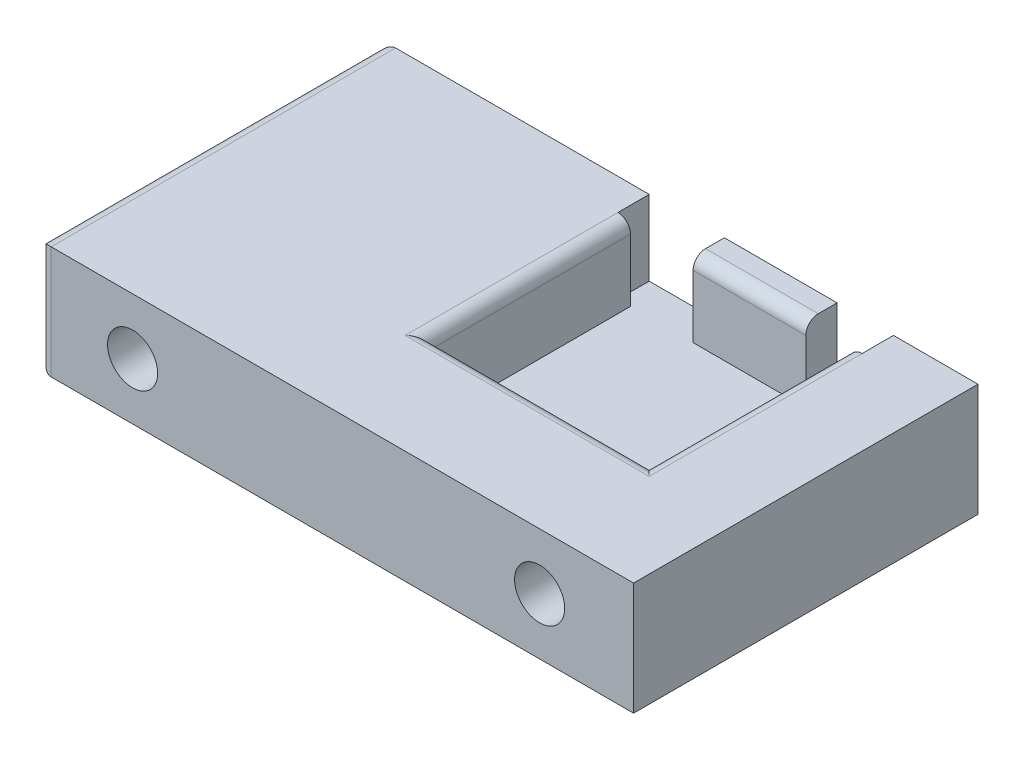
ISO-10303-21;
HEADER;
FILE_DESCRIPTION(('STEP AP214'),'2;1');
FILE_NAME('part.step','',(''),(''),'','','');
FILE_SCHEMA(('AUTOMOTIVE_DESIGN { 1 0 10303 214 1 1 1 1 }'));
ENDSEC;
DATA;
#1=APPLICATION_CONTEXT('core data for automotive mechanical design processes');
#2=APPLICATION_PROTOCOL_DEFINITION('international standard','automotive_design',2000,#1);
#3=PRODUCT_CONTEXT('',#1,'mechanical');
#4=PRODUCT('Part','Part','',(#3));
#5=PRODUCT_RELATED_PRODUCT_CATEGORY('part','',(#4));
#6=PRODUCT_DEFINITION_FORMATION('','',#4);
#7=PRODUCT_DEFINITION_CONTEXT('part definition',#1,'design');
#8=PRODUCT_DEFINITION('design','',#6,#7);
#9=PRODUCT_DEFINITION_SHAPE('','',#8);
#10=(LENGTH_UNIT() NAMED_UNIT(*) SI_UNIT(.MILLI.,.METRE.));
#11=(NAMED_UNIT(*) PLANE_ANGLE_UNIT() SI_UNIT($,.RADIAN.));
#12=(NAMED_UNIT(*) SI_UNIT($,.STERADIAN.) SOLID_ANGLE_UNIT());
#13=UNCERTAINTY_MEASURE_WITH_UNIT(LENGTH_MEASURE(1.E-05),#10,'distance_accuracy_value','');
#14=(GEOMETRIC_REPRESENTATION_CONTEXT(3) GLOBAL_UNCERTAINTY_ASSIGNED_CONTEXT((#13)) GLOBAL_UNIT_ASSIGNED_CONTEXT((#10,
#11,#12)) REPRESENTATION_CONTEXT('',''));
#15=CARTESIAN_POINT('',(0.,0.,0.));
#16=DIRECTION('',(0.,0.,1.));
#17=DIRECTION('',(1.,0.,0.));
#18=AXIS2_PLACEMENT_3D('',#15,#16,#17);
#19=CARTESIAN_POINT('',(0.,18.,0.));
#20=DIRECTION('',(0.,1.,0.));
#21=DIRECTION('',(0.,0.,1.));
#22=AXIS2_PLACEMENT_3D('',#19,#20,#21);
#23=PLANE('',#22);
#24=DIRECTION('',(0.,0.,1.));
#25=VECTOR('',#24,1.);
#26=CARTESIAN_POINT('',(72.5,18.,0.));
#27=LINE('',#26,#25);
#28=CARTESIAN_POINT('',(72.5,18.,0.));
#29=VERTEX_POINT('',#28);
#30=CARTESIAN_POINT('',(72.5,18.,3.));
#31=VERTEX_POINT('',#30);
#32=EDGE_CURVE('E193',#29,#31,#27,.T.);
#33=ORIENTED_EDGE('',*,*,#32,.F.);
#34=DIRECTION('',(-1.,0.,0.));
#35=VECTOR('',#34,1.);
#36=CARTESIAN_POINT('',(0.,18.,0.));
#37=LINE('',#36,#35);
#38=CARTESIAN_POINT('',(54.5,18.,0.));
#39=VERTEX_POINT('',#38);
#40=EDGE_CURVE('E238',#29,#39,#37,.T.);
#41=ORIENTED_EDGE('',*,*,#40,.T.);
#42=DIRECTION('',(0.,0.,-1.));
#43=VECTOR('',#42,1.);
#44=CARTESIAN_POINT('',(54.5,18.,0.));
#45=LINE('',#44,#43);
#46=CARTESIAN_POINT('',(54.5,18.,3.));
#47=VERTEX_POINT('',#46);
#48=EDGE_CURVE('E337',#47,#39,#45,.T.);
#49=ORIENTED_EDGE('',*,*,#48,.F.);
#50=DIRECTION('',(-1.,0.,0.));
#51=VECTOR('',#50,1.);
#52=CARTESIAN_POINT('',(79.5,18.,3.));
#53=LINE('',#52,#51);
#54=EDGE_CURVE('E266',#47,#31,#53,.F.);
#55=ORIENTED_EDGE('',*,*,#54,.T.);
#56=EDGE_LOOP('',(#33,#41,#49,#55));
#57=FACE_BOUND('',#56,.T.);
#58=ADVANCED_FACE('F37',(#57),#23,.T.);
#59=CARTESIAN_POINT('',(0.,18.,0.));
#60=DIRECTION('',(1.,0.,0.));
#61=DIRECTION('',(0.,0.,-1.));
#62=AXIS2_PLACEMENT_3D('',#59,#60,#61);
#63=PLANE('',#62);
#64=DIRECTION('',(0.,0.,1.));
#65=VECTOR('',#64,1.);
#66=CARTESIAN_POINT('',(0.,16.,0.));
#67=LINE('',#66,#65);
#68=CARTESIAN_POINT('',(0.,16.,53.));
#69=VERTEX_POINT('',#68);
#70=CARTESIAN_POINT('',(0.,16.,2.));
#71=VERTEX_POINT('',#70);
#72=EDGE_CURVE('E253',#69,#71,#67,.F.);
#73=ORIENTED_EDGE('',*,*,#72,.T.);
#74=DIRECTION('',(0.,-1.,0.));
#75=VECTOR('',#74,1.);
#76=CARTESIAN_POINT('',(0.,18.,2.));
#77=LINE('',#76,#75);
#78=CARTESIAN_POINT('',(0.,2.,2.));
#79=VERTEX_POINT('',#78);
#80=EDGE_CURVE('E255',#71,#79,#77,.T.);
#81=ORIENTED_EDGE('',*,*,#80,.T.);
#82=DIRECTION('',(0.,0.,1.));
#83=VECTOR('',#82,1.);
#84=CARTESIAN_POINT('',(0.,2.,0.));
#85=LINE('',#84,#83);
#86=CARTESIAN_POINT('',(0.,2.,53.));
#87=VERTEX_POINT('',#86);
#88=EDGE_CURVE('E251',#79,#87,#85,.T.);
#89=ORIENTED_EDGE('',*,*,#88,.T.);
#90=DIRECTION('',(0.,-1.,0.));
#91=VECTOR('',#90,1.);
#92=CARTESIAN_POINT('',(0.,18.,53.));
#93=LINE('',#92,#91);
#94=EDGE_CURVE('E249',#87,#69,#93,.F.);
#95=ORIENTED_EDGE('',*,*,#94,.T.);
#96=EDGE_LOOP('',(#73,#81,#89,#95));
#97=FACE_BOUND('',#96,.T.);
#98=ADVANCED_FACE('F379',(#97),#63,.F.);
#99=CARTESIAN_POINT('',(0.,18.,55.));
#100=DIRECTION('',(0.,0.,-1.));
#101=DIRECTION('',(-1.,0.,0.));
#102=AXIS2_PLACEMENT_3D('',#99,#100,#101);
#103=PLANE('',#102);
#104=CARTESIAN_POINT('',(80.,9.,55.));
#105=DIRECTION('',(0.,0.,1.));
#106=DIRECTION('',(1.,0.,0.));
#107=AXIS2_PLACEMENT_3D('',#104,#105,#106);
#108=CIRCLE('',#107,4.00000000000001);
#109=CARTESIAN_POINT('',(84.,9.,55.));
#110=VERTEX_POINT('',#109);
#111=EDGE_CURVE('E220',#110,#110,#108,.T.);
#112=ORIENTED_EDGE('',*,*,#111,.F.);
#113=EDGE_LOOP('',(#112));
#114=FACE_BOUND('',#113,.T.);
#115=CARTESIAN_POINT('',(15.,9.,55.));
#116=DIRECTION('',(0.,0.,1.));
#117=DIRECTION('',(1.,0.,0.));
#118=AXIS2_PLACEMENT_3D('',#115,#116,#117);
#119=CIRCLE('',#118,4.);
#120=CARTESIAN_POINT('',(19.,9.,55.));
#121=VERTEX_POINT('',#120);
#122=EDGE_CURVE('E211',#121,#121,#119,.T.);
#123=ORIENTED_EDGE('',*,*,#122,.F.);
#124=EDGE_LOOP('',(#123));
#125=FACE_BOUND('',#124,.T.);
#126=DIRECTION('',(1.,0.,0.));
#127=VECTOR('',#126,1.);
#128=CARTESIAN_POINT('',(0.,18.,55.));
#129=LINE('',#128,#127);
#130=CARTESIAN_POINT('',(2.00000000000001,18.,55.));
#131=VERTEX_POINT('',#130);
#132=CARTESIAN_POINT('',(95.,18.,55.));
#133=VERTEX_POINT('',#132);
#134=EDGE_CURVE('E228',#131,#133,#129,.T.);
#135=ORIENTED_EDGE('',*,*,#134,.F.);
#136=DIRECTION('',(0.,-1.,0.));
#137=VECTOR('',#136,1.);
#138=CARTESIAN_POINT('',(2.00000000000001,18.,55.));
#139=LINE('',#138,#137);
#140=CARTESIAN_POINT('',(2.00000000000001,0.,55.));
#141=VERTEX_POINT('',#140);
#142=EDGE_CURVE('E277',#131,#141,#139,.T.);
#143=ORIENTED_EDGE('',*,*,#142,.T.);
#144=DIRECTION('',(1.,0.,0.));
#145=VECTOR('',#144,1.);
#146=CARTESIAN_POINT('',(0.,0.,55.));
#147=LINE('',#146,#145);
#148=CARTESIAN_POINT('',(95.,0.,55.));
#149=VERTEX_POINT('',#148);
#150=EDGE_CURVE('E219',#141,#149,#147,.T.);
#151=ORIENTED_EDGE('',*,*,#150,.T.);
#152=DIRECTION('',(0.,-1.,0.));
#153=VECTOR('',#152,1.);
#154=CARTESIAN_POINT('',(95.,18.,55.));
#155=LINE('',#154,#153);
#156=EDGE_CURVE('E246',#133,#149,#155,.T.);
#157=ORIENTED_EDGE('',*,*,#156,.F.);
#158=EDGE_LOOP('',(#135,#143,#151,#157));
#159=FACE_BOUND('',#158,.T.);
#160=ADVANCED_FACE('F385',(#114,#125,#159),#103,.F.);
#161=CARTESIAN_POINT('',(95.,18.,0.));
#162=DIRECTION('',(-1.,0.,0.));
#163=DIRECTION('',(0.,0.,1.));
#164=AXIS2_PLACEMENT_3D('',#161,#162,#163);
#165=PLANE('',#164);
#166=DIRECTION('',(0.,0.,-1.));
#167=VECTOR('',#166,1.);
#168=CARTESIAN_POINT('',(95.,0.,0.));
#169=LINE('',#168,#167);
#170=CARTESIAN_POINT('',(95.,0.,0.));
#171=VERTEX_POINT('',#170);
#172=EDGE_CURVE('E240',#149,#171,#169,.T.);
#173=ORIENTED_EDGE('',*,*,#172,.T.);
#174=DIRECTION('',(0.,-1.,0.));
#175=VECTOR('',#174,1.);
#176=CARTESIAN_POINT('',(95.,18.,0.));
#177=LINE('',#176,#175);
#178=CARTESIAN_POINT('',(95.,18.,0.));
#179=VERTEX_POINT('',#178);
#180=EDGE_CURVE('E237',#179,#171,#177,.T.);
#181=ORIENTED_EDGE('',*,*,#180,.F.);
#182=DIRECTION('',(0.,0.,-1.));
#183=VECTOR('',#182,1.);
#184=CARTESIAN_POINT('',(95.,18.,0.));
#185=LINE('',#184,#183);
#186=EDGE_CURVE('E230',#133,#179,#185,.T.);
#187=ORIENTED_EDGE('',*,*,#186,.F.);
#188=ORIENTED_EDGE('',*,*,#156,.T.);
#189=EDGE_LOOP('',(#173,#181,#187,#188));
#190=FACE_BOUND('',#189,.T.);
#191=ADVANCED_FACE('F399',(#190),#165,.F.);
#192=CARTESIAN_POINT('',(0.,18.,0.));
#193=DIRECTION('',(0.,0.,1.));
#194=DIRECTION('',(1.,0.,0.));
#195=AXIS2_PLACEMENT_3D('',#192,#193,#194);
#196=PLANE('',#195);
#197=ORIENTED_EDGE('',*,*,#40,.F.);
#198=DIRECTION('',(0.,1.,0.));
#199=VECTOR('',#198,1.);
#200=CARTESIAN_POINT('',(72.5,6.,0.));
#201=LINE('',#200,#199);
#202=CARTESIAN_POINT('',(72.5,6.,0.));
#203=VERTEX_POINT('',#202);
#204=EDGE_CURVE('E326',#203,#29,#201,.T.);
#205=ORIENTED_EDGE('',*,*,#204,.F.);
#206=DIRECTION('',(-1.,0.,0.));
#207=VECTOR('',#206,1.);
#208=CARTESIAN_POINT('',(72.5,6.,0.));
#209=LINE('',#208,#207);
#210=CARTESIAN_POINT('',(81.5,6.,0.));
#211=VERTEX_POINT('',#210);
#212=EDGE_CURVE('E181',#211,#203,#209,.T.);
#213=ORIENTED_EDGE('',*,*,#212,.F.);
#214=DIRECTION('',(0.,1.,0.));
#215=VECTOR('',#214,1.);
#216=CARTESIAN_POINT('',(81.5,6.,0.));
#217=LINE('',#216,#215);
#218=CARTESIAN_POINT('',(81.5,18.,0.));
#219=VERTEX_POINT('',#218);
#220=EDGE_CURVE('E322',#211,#219,#217,.T.);
#221=ORIENTED_EDGE('',*,*,#220,.T.);
#222=EDGE_CURVE('E234',#179,#219,#37,.T.);
#223=ORIENTED_EDGE('',*,*,#222,.F.);
#224=ORIENTED_EDGE('',*,*,#180,.T.);
#225=DIRECTION('',(-1.,0.,0.));
#226=VECTOR('',#225,1.);
#227=CARTESIAN_POINT('',(0.,0.,0.));
#228=LINE('',#227,#226);
#229=CARTESIAN_POINT('',(2.,0.,0.));
#230=VERTEX_POINT('',#229);
#231=EDGE_CURVE('E231',#171,#230,#228,.T.);
#232=ORIENTED_EDGE('',*,*,#231,.T.);
#233=DIRECTION('',(0.,-1.,0.));
#234=VECTOR('',#233,1.);
#235=CARTESIAN_POINT('',(2.,18.,0.));
#236=LINE('',#235,#234);
#237=CARTESIAN_POINT('',(2.,18.,0.));
#238=VERTEX_POINT('',#237);
#239=EDGE_CURVE('E258',#230,#238,#236,.F.);
#240=ORIENTED_EDGE('',*,*,#239,.T.);
#241=CARTESIAN_POINT('',(42.5,18.,0.));
#242=VERTEX_POINT('',#241);
#243=EDGE_CURVE('E233',#242,#238,#37,.T.);
#244=ORIENTED_EDGE('',*,*,#243,.F.);
#245=DIRECTION('',(0.,1.,0.));
#246=VECTOR('',#245,1.);
#247=CARTESIAN_POINT('',(42.5,6.,0.));
#248=LINE('',#247,#246);
#249=CARTESIAN_POINT('',(42.5,6.,0.));
#250=VERTEX_POINT('',#249);
#251=EDGE_CURVE('E349',#250,#242,#248,.T.);
#252=ORIENTED_EDGE('',*,*,#251,.F.);
#253=DIRECTION('',(-1.,0.,0.));
#254=VECTOR('',#253,1.);
#255=CARTESIAN_POINT('',(42.5,6.,0.));
#256=LINE('',#255,#254);
#257=CARTESIAN_POINT('',(54.5,6.,0.));
#258=VERTEX_POINT('',#257);
#259=EDGE_CURVE('E342',#258,#250,#256,.T.);
#260=ORIENTED_EDGE('',*,*,#259,.F.);
#261=DIRECTION('',(0.,1.,0.));
#262=VECTOR('',#261,1.);
#263=CARTESIAN_POINT('',(54.5,6.,0.));
#264=LINE('',#263,#262);
#265=EDGE_CURVE('E352',#258,#39,#264,.T.);
#266=ORIENTED_EDGE('',*,*,#265,.T.);
#267=EDGE_LOOP('',(#197,#205,#213,#221,#223,#224,#232,#240,#244,#252,#260,#266));
#268=FACE_BOUND('',#267,.T.);
#269=ADVANCED_FACE('F325',(#268),#196,.F.);
#270=ORIENTED_EDGE('',*,*,#222,.T.);
#271=DIRECTION('',(0.,0.,-1.));
#272=VECTOR('',#271,1.);
#273=CARTESIAN_POINT('',(81.5,18.,37.));
#274=LINE('',#273,#272);
#275=CARTESIAN_POINT('',(81.5,18.,5.));
#276=VERTEX_POINT('',#275);
#277=EDGE_CURVE('E270',#219,#276,#274,.F.);
#278=ORIENTED_EDGE('',*,*,#277,.T.);
#279=CARTESIAN_POINT('',(81.5,18.,39.));
#280=VERTEX_POINT('',#279);
#281=EDGE_CURVE('E269',#276,#280,#274,.F.);
#282=ORIENTED_EDGE('',*,*,#281,.T.);
#283=DIRECTION('',(1.,0.,0.));
#284=VECTOR('',#283,1.);
#285=CARTESIAN_POINT('',(44.5,18.,39.));
#286=LINE('',#285,#284);
#287=CARTESIAN_POINT('',(42.5,18.,39.));
#288=VERTEX_POINT('',#287);
#289=EDGE_CURVE('E261',#280,#288,#286,.F.);
#290=ORIENTED_EDGE('',*,*,#289,.T.);
#291=DIRECTION('',(0.,0.,1.));
#292=VECTOR('',#291,1.);
#293=CARTESIAN_POINT('',(42.5,18.,5.));
#294=LINE('',#293,#292);
#295=CARTESIAN_POINT('',(42.5,18.,5.));
#296=VERTEX_POINT('',#295);
#297=EDGE_CURVE('E263',#288,#296,#294,.F.);
#298=ORIENTED_EDGE('',*,*,#297,.T.);
#299=DIRECTION('',(0.,0.,1.));
#300=VECTOR('',#299,1.);
#301=CARTESIAN_POINT('',(42.5,18.,0.));
#302=LINE('',#301,#300);
#303=EDGE_CURVE('E328',#242,#296,#302,.T.);
#304=ORIENTED_EDGE('',*,*,#303,.F.);
#305=ORIENTED_EDGE('',*,*,#243,.T.);
#306=DIRECTION('',(0.,0.,1.));
#307=VECTOR('',#306,1.);
#308=CARTESIAN_POINT('',(2.00000000000001,18.,55.));
#309=LINE('',#308,#307);
#310=EDGE_CURVE('E273',#238,#131,#309,.T.);
#311=ORIENTED_EDGE('',*,*,#310,.T.);
#312=ORIENTED_EDGE('',*,*,#134,.T.);
#313=ORIENTED_EDGE('',*,*,#186,.T.);
#314=EDGE_LOOP('',(#270,#278,#282,#290,#298,#304,#305,#311,#312,#313));
#315=FACE_BOUND('',#314,.T.);
#316=ADVANCED_FACE('F318',(#315),#23,.T.);
#317=CARTESIAN_POINT('',(0.,0.,0.));
#318=DIRECTION('',(0.,1.,0.));
#319=DIRECTION('',(0.,0.,1.));
#320=AXIS2_PLACEMENT_3D('',#317,#318,#319);
#321=PLANE('',#320);
#322=ORIENTED_EDGE('',*,*,#150,.F.);
#323=DIRECTION('',(0.,0.,1.));
#324=VECTOR('',#323,1.);
#325=CARTESIAN_POINT('',(2.,0.,0.));
#326=LINE('',#325,#324);
#327=EDGE_CURVE('E275',#141,#230,#326,.F.);
#328=ORIENTED_EDGE('',*,*,#327,.T.);
#329=ORIENTED_EDGE('',*,*,#231,.F.);
#330=ORIENTED_EDGE('',*,*,#172,.F.);
#331=EDGE_LOOP('',(#322,#328,#329,#330));
#332=FACE_BOUND('',#331,.T.);
#333=ADVANCED_FACE('F392',(#332),#321,.F.);
#334=CARTESIAN_POINT('',(15.,9.,40.));
#335=DIRECTION('',(0.,0.,1.));
#336=DIRECTION('',(1.,0.,0.));
#337=AXIS2_PLACEMENT_3D('',#334,#335,#336);
#338=CYLINDRICAL_SURFACE('',#337,4.);
#339=CARTESIAN_POINT('',(15.,9.,40.));
#340=DIRECTION('',(0.,0.,1.));
#341=DIRECTION('',(1.,0.,0.));
#342=AXIS2_PLACEMENT_3D('',#339,#340,#341);
#343=CIRCLE('',#342,4.);
#344=CARTESIAN_POINT('',(19.,9.,40.));
#345=VERTEX_POINT('',#344);
#346=EDGE_CURVE('E223',#345,#345,#343,.T.);
#347=ORIENTED_EDGE('',*,*,#346,.F.);
#348=EDGE_LOOP('',(#347));
#349=FACE_BOUND('',#348,.T.);
#350=ORIENTED_EDGE('',*,*,#122,.T.);
#351=EDGE_LOOP('',(#350));
#352=FACE_BOUND('',#351,.T.);
#353=ADVANCED_FACE('F397',(#349,#352),#338,.F.);
#354=CARTESIAN_POINT('',(15.,9.,40.));
#355=DIRECTION('',(0.,0.,1.));
#356=DIRECTION('',(1.,0.,0.));
#357=AXIS2_PLACEMENT_3D('',#354,#355,#356);
#358=PLANE('',#357);
#359=ORIENTED_EDGE('',*,*,#346,.T.);
#360=EDGE_LOOP('',(#359));
#361=FACE_BOUND('',#360,.T.);
#362=ADVANCED_FACE('F669',(#361),#358,.T.);
#363=CARTESIAN_POINT('',(80.,9.,40.));
#364=DIRECTION('',(0.,0.,1.));
#365=DIRECTION('',(1.,0.,0.));
#366=AXIS2_PLACEMENT_3D('',#363,#364,#365);
#367=CYLINDRICAL_SURFACE('',#366,4.00000000000001);
#368=CARTESIAN_POINT('',(80.,9.,40.));
#369=DIRECTION('',(0.,0.,1.));
#370=DIRECTION('',(1.,0.,0.));
#371=AXIS2_PLACEMENT_3D('',#368,#369,#370);
#372=CIRCLE('',#371,4.00000000000001);
#373=CARTESIAN_POINT('',(84.,9.,40.));
#374=VERTEX_POINT('',#373);
#375=EDGE_CURVE('E216',#374,#374,#372,.T.);
#376=ORIENTED_EDGE('',*,*,#375,.F.);
#377=EDGE_LOOP('',(#376));
#378=FACE_BOUND('',#377,.T.);
#379=ORIENTED_EDGE('',*,*,#111,.T.);
#380=EDGE_LOOP('',(#379));
#381=FACE_BOUND('',#380,.T.);
#382=ADVANCED_FACE('F658',(#378,#381),#367,.F.);
#383=CARTESIAN_POINT('',(80.,9.,40.));
#384=DIRECTION('',(0.,0.,1.));
#385=DIRECTION('',(1.,0.,0.));
#386=AXIS2_PLACEMENT_3D('',#383,#384,#385);
#387=PLANE('',#386);
#388=ORIENTED_EDGE('',*,*,#375,.T.);
#389=EDGE_LOOP('',(#388));
#390=FACE_BOUND('',#389,.T.);
#391=ADVANCED_FACE('F653',(#390),#387,.T.);
#392=CARTESIAN_POINT('',(44.5,6.,5.));
#393=DIRECTION('',(-1.,0.,0.));
#394=DIRECTION('',(0.,0.,1.));
#395=AXIS2_PLACEMENT_3D('',#392,#393,#394);
#396=PLANE('',#395);
#397=DIRECTION('',(0.,1.,0.));
#398=VECTOR('',#397,1.);
#399=CARTESIAN_POINT('',(44.5,6.,5.));
#400=LINE('',#399,#398);
#401=CARTESIAN_POINT('',(44.5,6.,5.));
#402=VERTEX_POINT('',#401);
#403=CARTESIAN_POINT('',(44.5,16.,5.));
#404=VERTEX_POINT('',#403);
#405=EDGE_CURVE('E208',#402,#404,#400,.T.);
#406=ORIENTED_EDGE('',*,*,#405,.T.);
#407=DIRECTION('',(0.,0.,1.));
#408=VECTOR('',#407,1.);
#409=CARTESIAN_POINT('',(44.5,16.,37.));
#410=LINE('',#409,#408);
#411=CARTESIAN_POINT('',(44.5,16.,37.));
#412=VERTEX_POINT('',#411);
#413=EDGE_CURVE('E283',#404,#412,#410,.T.);
#414=ORIENTED_EDGE('',*,*,#413,.T.);
#415=DIRECTION('',(0.,1.,0.));
#416=VECTOR('',#415,1.);
#417=CARTESIAN_POINT('',(44.5,6.,37.));
#418=LINE('',#417,#416);
#419=CARTESIAN_POINT('',(44.5,6.,37.));
#420=VERTEX_POINT('',#419);
#421=EDGE_CURVE('E197',#420,#412,#418,.T.);
#422=ORIENTED_EDGE('',*,*,#421,.F.);
#423=DIRECTION('',(0.,0.,1.));
#424=VECTOR('',#423,1.);
#425=CARTESIAN_POINT('',(44.5,6.,5.));
#426=LINE('',#425,#424);
#427=EDGE_CURVE('E300',#402,#420,#426,.T.);
#428=ORIENTED_EDGE('',*,*,#427,.F.);
#429=EDGE_LOOP('',(#406,#414,#422,#428));
#430=FACE_BOUND('',#429,.T.);
#431=ADVANCED_FACE('F376',(#430),#396,.F.);
#432=CARTESIAN_POINT('',(44.5,6.,5.));
#433=DIRECTION('',(0.,0.,-1.));
#434=DIRECTION('',(-1.,0.,0.));
#435=AXIS2_PLACEMENT_3D('',#432,#433,#434);
#436=PLANE('',#435);
#437=DIRECTION('',(-1.,0.,0.));
#438=VECTOR('',#437,1.);
#439=CARTESIAN_POINT('',(44.5,6.,5.));
#440=LINE('',#439,#438);
#441=CARTESIAN_POINT('',(72.5,6.,5.));
#442=VERTEX_POINT('',#441);
#443=CARTESIAN_POINT('',(54.5,6.,5.));
#444=VERTEX_POINT('',#443);
#445=EDGE_CURVE('E187',#442,#444,#440,.T.);
#446=ORIENTED_EDGE('',*,*,#445,.F.);
#447=DIRECTION('',(0.,1.,0.));
#448=VECTOR('',#447,1.);
#449=CARTESIAN_POINT('',(72.5,6.,5.));
#450=LINE('',#449,#448);
#451=CARTESIAN_POINT('',(72.5,16.,5.));
#452=VERTEX_POINT('',#451);
#453=EDGE_CURVE('E174',#442,#452,#450,.T.);
#454=ORIENTED_EDGE('',*,*,#453,.T.);
#455=DIRECTION('',(-1.,0.,0.));
#456=VECTOR('',#455,1.);
#457=CARTESIAN_POINT('',(44.5,16.,5.));
#458=LINE('',#457,#456);
#459=CARTESIAN_POINT('',(54.5,16.,5.));
#460=VERTEX_POINT('',#459);
#461=EDGE_CURVE('E60',#452,#460,#458,.T.);
#462=ORIENTED_EDGE('',*,*,#461,.T.);
#463=DIRECTION('',(0.,1.,0.));
#464=VECTOR('',#463,1.);
#465=CARTESIAN_POINT('',(54.5,6.,5.));
#466=LINE('',#465,#464);
#467=EDGE_CURVE('E196',#444,#460,#466,.T.);
#468=ORIENTED_EDGE('',*,*,#467,.F.);
#469=EDGE_LOOP('',(#446,#454,#462,#468));
#470=FACE_BOUND('',#469,.T.);
#471=ADVANCED_FACE('F195',(#470),#436,.F.);
#472=CARTESIAN_POINT('',(79.5,6.,5.));
#473=DIRECTION('',(1.,0.,0.));
#474=DIRECTION('',(0.,0.,-1.));
#475=AXIS2_PLACEMENT_3D('',#472,#473,#474);
#476=PLANE('',#475);
#477=DIRECTION('',(0.,1.,0.));
#478=VECTOR('',#477,1.);
#479=CARTESIAN_POINT('',(79.5,6.,37.));
#480=LINE('',#479,#478);
#481=CARTESIAN_POINT('',(79.5,6.,37.));
#482=VERTEX_POINT('',#481);
#483=CARTESIAN_POINT('',(79.5,16.,37.));
#484=VERTEX_POINT('',#483);
#485=EDGE_CURVE('E201',#482,#484,#480,.T.);
#486=ORIENTED_EDGE('',*,*,#485,.T.);
#487=DIRECTION('',(0.,0.,-1.));
#488=VECTOR('',#487,1.);
#489=CARTESIAN_POINT('',(79.5,16.,5.));
#490=LINE('',#489,#488);
#491=CARTESIAN_POINT('',(79.5,16.,5.));
#492=VERTEX_POINT('',#491);
#493=EDGE_CURVE('E279',#484,#492,#490,.T.);
#494=ORIENTED_EDGE('',*,*,#493,.T.);
#495=DIRECTION('',(0.,1.,0.));
#496=VECTOR('',#495,1.);
#497=CARTESIAN_POINT('',(79.5,6.,5.));
#498=LINE('',#497,#496);
#499=CARTESIAN_POINT('',(79.5,6.,5.));
#500=VERTEX_POINT('',#499);
#501=EDGE_CURVE('E212',#500,#492,#498,.T.);
#502=ORIENTED_EDGE('',*,*,#501,.F.);
#503=DIRECTION('',(0.,0.,-1.));
#504=VECTOR('',#503,1.);
#505=CARTESIAN_POINT('',(79.5,6.,5.));
#506=LINE('',#505,#504);
#507=EDGE_CURVE('E198',#482,#500,#506,.T.);
#508=ORIENTED_EDGE('',*,*,#507,.F.);
#509=EDGE_LOOP('',(#486,#494,#502,#508));
#510=FACE_BOUND('',#509,.T.);
#511=ADVANCED_FACE('F368',(#510),#476,.F.);
#512=CARTESIAN_POINT('',(44.5,6.,37.));
#513=DIRECTION('',(0.,0.,1.));
#514=DIRECTION('',(1.,0.,0.));
#515=AXIS2_PLACEMENT_3D('',#512,#513,#514);
#516=PLANE('',#515);
#517=ORIENTED_EDGE('',*,*,#421,.T.);
#518=DIRECTION('',(1.,0.,0.));
#519=VECTOR('',#518,1.);
#520=CARTESIAN_POINT('',(79.5,16.,37.));
#521=LINE('',#520,#519);
#522=EDGE_CURVE('E285',#412,#484,#521,.T.);
#523=ORIENTED_EDGE('',*,*,#522,.T.);
#524=ORIENTED_EDGE('',*,*,#485,.F.);
#525=DIRECTION('',(1.,0.,0.));
#526=VECTOR('',#525,1.);
#527=CARTESIAN_POINT('',(44.5,6.,37.));
#528=LINE('',#527,#526);
#529=EDGE_CURVE('E204',#420,#482,#528,.T.);
#530=ORIENTED_EDGE('',*,*,#529,.F.);
#531=EDGE_LOOP('',(#517,#523,#524,#530));
#532=FACE_BOUND('',#531,.T.);
#533=ADVANCED_FACE('F364',(#532),#516,.F.);
#534=CARTESIAN_POINT('',(0.,6.,0.));
#535=DIRECTION('',(0.,1.,0.));
#536=DIRECTION('',(0.,0.,1.));
#537=AXIS2_PLACEMENT_3D('',#534,#535,#536);
#538=PLANE('',#537);
#539=ORIENTED_EDGE('',*,*,#427,.T.);
#540=ORIENTED_EDGE('',*,*,#529,.T.);
#541=ORIENTED_EDGE('',*,*,#507,.T.);
#542=DIRECTION('',(1.,0.,0.));
#543=VECTOR('',#542,1.);
#544=CARTESIAN_POINT('',(72.5,6.,5.));
#545=LINE('',#544,#543);
#546=CARTESIAN_POINT('',(81.5,6.,5.));
#547=VERTEX_POINT('',#546);
#548=EDGE_CURVE('E192',#500,#547,#545,.T.);
#549=ORIENTED_EDGE('',*,*,#548,.T.);
#550=DIRECTION('',(0.,0.,-1.));
#551=VECTOR('',#550,1.);
#552=CARTESIAN_POINT('',(81.5,6.,0.));
#553=LINE('',#552,#551);
#554=EDGE_CURVE('E736',#547,#211,#553,.T.);
#555=ORIENTED_EDGE('',*,*,#554,.T.);
#556=ORIENTED_EDGE('',*,*,#212,.T.);
#557=DIRECTION('',(0.,0.,1.));
#558=VECTOR('',#557,1.);
#559=CARTESIAN_POINT('',(72.5,6.,0.));
#560=LINE('',#559,#558);
#561=EDGE_CURVE('E177',#203,#442,#560,.T.);
#562=ORIENTED_EDGE('',*,*,#561,.T.);
#563=ORIENTED_EDGE('',*,*,#445,.T.);
#564=DIRECTION('',(0.,0.,-1.));
#565=VECTOR('',#564,1.);
#566=CARTESIAN_POINT('',(54.5,6.,0.));
#567=LINE('',#566,#565);
#568=EDGE_CURVE('E340',#444,#258,#567,.T.);
#569=ORIENTED_EDGE('',*,*,#568,.T.);
#570=ORIENTED_EDGE('',*,*,#259,.T.);
#571=DIRECTION('',(0.,0.,1.));
#572=VECTOR('',#571,1.);
#573=CARTESIAN_POINT('',(42.5,6.,0.));
#574=LINE('',#573,#572);
#575=CARTESIAN_POINT('',(42.5,6.,5.));
#576=VERTEX_POINT('',#575);
#577=EDGE_CURVE('E333',#250,#576,#574,.T.);
#578=ORIENTED_EDGE('',*,*,#577,.T.);
#579=DIRECTION('',(1.,0.,0.));
#580=VECTOR('',#579,1.);
#581=CARTESIAN_POINT('',(42.5,6.,5.));
#582=LINE('',#581,#580);
#583=EDGE_CURVE('E336',#576,#402,#582,.T.);
#584=ORIENTED_EDGE('',*,*,#583,.T.);
#585=EDGE_LOOP('',(#539,#540,#541,#549,#555,#556,#562,#563,#569,#570,#578,#584));
#586=FACE_BOUND('',#585,.T.);
#587=ADVANCED_FACE('F185',(#586),#538,.T.);
#588=CARTESIAN_POINT('',(2.00000000000001,18.,53.));
#589=DIRECTION('',(0.,-1.,0.));
#590=DIRECTION('',(0.,0.,-1.));
#591=AXIS2_PLACEMENT_3D('',#588,#589,#590);
#592=CYLINDRICAL_SURFACE('',#591,2.);
#593=CARTESIAN_POINT('',(2.00000000000001,2.,53.));
#594=DIRECTION('',(0.,-0.707106781186547,-0.707106781186547));
#595=DIRECTION('',(0.,-0.707106781186547,0.707106781186547));
#596=AXIS2_PLACEMENT_3D('',#593,#594,#595);
#597=ELLIPSE('',#596,2.82842712474619,2.);
#598=EDGE_CURVE('E294',#141,#87,#597,.T.);
#599=ORIENTED_EDGE('',*,*,#598,.F.);
#600=ORIENTED_EDGE('',*,*,#142,.F.);
#601=CARTESIAN_POINT('',(2.00000000000001,16.,53.));
#602=DIRECTION('',(0.,-0.707106781186547,0.707106781186547));
#603=DIRECTION('',(0.,-0.707106781186547,-0.707106781186547));
#604=AXIS2_PLACEMENT_3D('',#601,#602,#603);
#605=ELLIPSE('',#604,2.82842712474619,2.);
#606=EDGE_CURVE('E297',#69,#131,#605,.F.);
#607=ORIENTED_EDGE('',*,*,#606,.F.);
#608=ORIENTED_EDGE('',*,*,#94,.F.);
#609=EDGE_LOOP('',(#599,#600,#607,#608));
#610=FACE_BOUND('',#609,.T.);
#611=ADVANCED_FACE('F421',(#610),#592,.T.);
#612=CARTESIAN_POINT('',(2.,16.,0.));
#613=DIRECTION('',(0.,0.,-1.));
#614=DIRECTION('',(-1.,0.,0.));
#615=AXIS2_PLACEMENT_3D('',#612,#613,#614);
#616=CYLINDRICAL_SURFACE('',#615,2.);
#617=ORIENTED_EDGE('',*,*,#606,.T.);
#618=ORIENTED_EDGE('',*,*,#310,.F.);
#619=CARTESIAN_POINT('',(2.,16.,2.));
#620=DIRECTION('',(0.,-0.707106781186547,-0.707106781186547));
#621=DIRECTION('',(0.,0.707106781186547,-0.707106781186547));
#622=AXIS2_PLACEMENT_3D('',#619,#620,#621);
#623=ELLIPSE('',#622,2.82842712474619,2.);
#624=EDGE_CURVE('E290',#71,#238,#623,.T.);
#625=ORIENTED_EDGE('',*,*,#624,.F.);
#626=ORIENTED_EDGE('',*,*,#72,.F.);
#627=EDGE_LOOP('',(#617,#618,#625,#626));
#628=FACE_BOUND('',#627,.T.);
#629=ADVANCED_FACE('F417',(#628),#616,.T.);
#630=CARTESIAN_POINT('',(2.,2.,0.));
#631=DIRECTION('',(0.,0.,1.));
#632=DIRECTION('',(1.,0.,0.));
#633=AXIS2_PLACEMENT_3D('',#630,#631,#632);
#634=CYLINDRICAL_SURFACE('',#633,2.);
#635=ORIENTED_EDGE('',*,*,#598,.T.);
#636=ORIENTED_EDGE('',*,*,#88,.F.);
#637=CARTESIAN_POINT('',(2.,2.,2.));
#638=DIRECTION('',(0.,-0.707106781186547,0.707106781186547));
#639=DIRECTION('',(0.,0.707106781186547,0.707106781186547));
#640=AXIS2_PLACEMENT_3D('',#637,#638,#639);
#641=ELLIPSE('',#640,2.82842712474619,2.);
#642=EDGE_CURVE('E288',#230,#79,#641,.F.);
#643=ORIENTED_EDGE('',*,*,#642,.F.);
#644=ORIENTED_EDGE('',*,*,#327,.F.);
#645=EDGE_LOOP('',(#635,#636,#643,#644));
#646=FACE_BOUND('',#645,.T.);
#647=ADVANCED_FACE('F413',(#646),#634,.T.);
#648=CARTESIAN_POINT('',(2.,18.,2.));
#649=DIRECTION('',(0.,-1.,0.));
#650=DIRECTION('',(0.,0.,-1.));
#651=AXIS2_PLACEMENT_3D('',#648,#649,#650);
#652=CYLINDRICAL_SURFACE('',#651,2.);
#653=ORIENTED_EDGE('',*,*,#624,.T.);
#654=ORIENTED_EDGE('',*,*,#239,.F.);
#655=ORIENTED_EDGE('',*,*,#642,.T.);
#656=ORIENTED_EDGE('',*,*,#80,.F.);
#657=EDGE_LOOP('',(#653,#654,#655,#656));
#658=FACE_BOUND('',#657,.T.);
#659=ADVANCED_FACE('F410',(#658),#652,.T.);
#660=CARTESIAN_POINT('',(42.5,16.,5.));
#661=DIRECTION('',(0.,0.,-1.));
#662=DIRECTION('',(-1.,0.,0.));
#663=AXIS2_PLACEMENT_3D('',#660,#661,#662);
#664=CYLINDRICAL_SURFACE('',#663,2.);
#665=CARTESIAN_POINT('',(42.5,16.,5.));
#666=DIRECTION('',(0.,0.,1.));
#667=DIRECTION('',(1.,0.,0.));
#668=AXIS2_PLACEMENT_3D('',#665,#666,#667);
#669=CIRCLE('',#668,2.);
#670=EDGE_CURVE('E304',#296,#404,#669,.F.);
#671=ORIENTED_EDGE('',*,*,#670,.F.);
#672=ORIENTED_EDGE('',*,*,#297,.F.);
#673=CARTESIAN_POINT('',(42.5,16.,39.));
#674=DIRECTION('',(-0.707106781186548,0.,-0.707106781186547));
#675=DIRECTION('',(0.707106781186547,0.,-0.707106781186548));
#676=AXIS2_PLACEMENT_3D('',#673,#674,#675);
#677=ELLIPSE('',#676,2.82842712474619,2.);
#678=EDGE_CURVE('E291',#412,#288,#677,.F.);
#679=ORIENTED_EDGE('',*,*,#678,.F.);
#680=ORIENTED_EDGE('',*,*,#413,.F.);
#681=EDGE_LOOP('',(#671,#672,#679,#680));
#682=FACE_BOUND('',#681,.T.);
#683=ADVANCED_FACE('F39',(#682),#664,.T.);
#684=CARTESIAN_POINT('',(44.5,16.,39.));
#685=DIRECTION('',(-1.,0.,0.));
#686=DIRECTION('',(0.,0.,1.));
#687=AXIS2_PLACEMENT_3D('',#684,#685,#686);
#688=CYLINDRICAL_SURFACE('',#687,2.);
#689=ORIENTED_EDGE('',*,*,#678,.T.);
#690=ORIENTED_EDGE('',*,*,#289,.F.);
#691=CARTESIAN_POINT('',(81.5,16.,39.));
#692=DIRECTION('',(-0.707106781186547,0.,0.707106781186547));
#693=DIRECTION('',(0.707106781186547,0.,0.707106781186547));
#694=AXIS2_PLACEMENT_3D('',#691,#692,#693);
#695=ELLIPSE('',#694,2.82842712474619,2.);
#696=EDGE_CURVE('E301',#484,#280,#695,.F.);
#697=ORIENTED_EDGE('',*,*,#696,.F.);
#698=ORIENTED_EDGE('',*,*,#522,.F.);
#699=EDGE_LOOP('',(#689,#690,#697,#698));
#700=FACE_BOUND('',#699,.T.);
#701=ADVANCED_FACE('F431',(#700),#688,.T.);
#702=CARTESIAN_POINT('',(44.5,16.,3.));
#703=DIRECTION('',(1.,0.,0.));
#704=DIRECTION('',(0.,0.,-1.));
#705=AXIS2_PLACEMENT_3D('',#702,#703,#704);
#706=CYLINDRICAL_SURFACE('',#705,2.);
#707=CARTESIAN_POINT('',(72.5,16.,3.));
#708=DIRECTION('',(-1.,0.,0.));
#709=DIRECTION('',(0.,0.,1.));
#710=AXIS2_PLACEMENT_3D('',#707,#708,#709);
#711=CIRCLE('',#710,2.);
#712=EDGE_CURVE('E11',#31,#452,#711,.F.);
#713=ORIENTED_EDGE('',*,*,#712,.F.);
#714=ORIENTED_EDGE('',*,*,#54,.F.);
#715=CARTESIAN_POINT('',(54.5,16.,3.));
#716=DIRECTION('',(1.,0.,0.));
#717=DIRECTION('',(0.,0.,-1.));
#718=AXIS2_PLACEMENT_3D('',#715,#716,#717);
#719=CIRCLE('',#718,2.);
#720=EDGE_CURVE('E287',#460,#47,#719,.F.);
#721=ORIENTED_EDGE('',*,*,#720,.F.);
#722=ORIENTED_EDGE('',*,*,#461,.F.);
#723=EDGE_LOOP('',(#713,#714,#721,#722));
#724=FACE_BOUND('',#723,.T.);
#725=ADVANCED_FACE('F429',(#724),#706,.T.);
#726=CARTESIAN_POINT('',(81.5,16.,5.));
#727=DIRECTION('',(0.,0.,1.));
#728=DIRECTION('',(1.,0.,0.));
#729=AXIS2_PLACEMENT_3D('',#726,#727,#728);
#730=CYLINDRICAL_SURFACE('',#729,2.);
#731=CARTESIAN_POINT('',(81.5,16.,5.));
#732=DIRECTION('',(0.,0.,1.));
#733=DIRECTION('',(1.,0.,0.));
#734=AXIS2_PLACEMENT_3D('',#731,#732,#733);
#735=CIRCLE('',#734,2.);
#736=EDGE_CURVE('E45',#492,#276,#735,.F.);
#737=ORIENTED_EDGE('',*,*,#736,.F.);
#738=ORIENTED_EDGE('',*,*,#493,.F.);
#739=ORIENTED_EDGE('',*,*,#696,.T.);
#740=ORIENTED_EDGE('',*,*,#281,.F.);
#741=EDGE_LOOP('',(#737,#738,#739,#740));
#742=FACE_BOUND('',#741,.T.);
#743=ADVANCED_FACE('F314',(#742),#730,.T.);
#744=CARTESIAN_POINT('',(42.5,6.,5.));
#745=DIRECTION('',(0.,0.,1.));
#746=DIRECTION('',(1.,0.,0.));
#747=AXIS2_PLACEMENT_3D('',#744,#745,#746);
#748=PLANE('',#747);
#749=ORIENTED_EDGE('',*,*,#583,.F.);
#750=DIRECTION('',(0.,1.,0.));
#751=VECTOR('',#750,1.);
#752=CARTESIAN_POINT('',(42.5,6.,5.));
#753=LINE('',#752,#751);
#754=EDGE_CURVE('E345',#576,#296,#753,.T.);
#755=ORIENTED_EDGE('',*,*,#754,.T.);
#756=ORIENTED_EDGE('',*,*,#670,.T.);
#757=ORIENTED_EDGE('',*,*,#405,.F.);
#758=EDGE_LOOP('',(#749,#755,#756,#757));
#759=FACE_BOUND('',#758,.T.);
#760=ADVANCED_FACE('F428',(#759),#748,.F.);
#761=CARTESIAN_POINT('',(42.5,6.,0.));
#762=DIRECTION('',(-1.,0.,0.));
#763=DIRECTION('',(0.,0.,1.));
#764=AXIS2_PLACEMENT_3D('',#761,#762,#763);
#765=PLANE('',#764);
#766=ORIENTED_EDGE('',*,*,#251,.T.);
#767=ORIENTED_EDGE('',*,*,#303,.T.);
#768=ORIENTED_EDGE('',*,*,#754,.F.);
#769=ORIENTED_EDGE('',*,*,#577,.F.);
#770=EDGE_LOOP('',(#766,#767,#768,#769));
#771=FACE_BOUND('',#770,.T.);
#772=ADVANCED_FACE('F445',(#771),#765,.F.);
#773=CARTESIAN_POINT('',(54.5,6.,0.));
#774=DIRECTION('',(1.,0.,0.));
#775=DIRECTION('',(0.,0.,-1.));
#776=AXIS2_PLACEMENT_3D('',#773,#774,#775);
#777=PLANE('',#776);
#778=ORIENTED_EDGE('',*,*,#720,.T.);
#779=ORIENTED_EDGE('',*,*,#48,.T.);
#780=ORIENTED_EDGE('',*,*,#265,.F.);
#781=ORIENTED_EDGE('',*,*,#568,.F.);
#782=ORIENTED_EDGE('',*,*,#467,.T.);
#783=EDGE_LOOP('',(#778,#779,#780,#781,#782));
#784=FACE_BOUND('',#783,.T.);
#785=ADVANCED_FACE('F451',(#784),#777,.F.);
#786=CARTESIAN_POINT('',(72.5,6.,5.));
#787=DIRECTION('',(0.,0.,1.));
#788=DIRECTION('',(1.,0.,0.));
#789=AXIS2_PLACEMENT_3D('',#786,#787,#788);
#790=PLANE('',#789);
#791=ORIENTED_EDGE('',*,*,#736,.T.);
#792=DIRECTION('',(0.,1.,0.));
#793=VECTOR('',#792,1.);
#794=CARTESIAN_POINT('',(81.5,6.,5.));
#795=LINE('',#794,#793);
#796=EDGE_CURVE('E52',#547,#276,#795,.T.);
#797=ORIENTED_EDGE('',*,*,#796,.F.);
#798=ORIENTED_EDGE('',*,*,#548,.F.);
#799=ORIENTED_EDGE('',*,*,#501,.T.);
#800=EDGE_LOOP('',(#791,#797,#798,#799));
#801=FACE_BOUND('',#800,.T.);
#802=ADVANCED_FACE('F310',(#801),#790,.F.);
#803=CARTESIAN_POINT('',(72.5,6.,0.));
#804=DIRECTION('',(-1.,0.,0.));
#805=DIRECTION('',(0.,0.,1.));
#806=AXIS2_PLACEMENT_3D('',#803,#804,#805);
#807=PLANE('',#806);
#808=ORIENTED_EDGE('',*,*,#712,.T.);
#809=ORIENTED_EDGE('',*,*,#453,.F.);
#810=ORIENTED_EDGE('',*,*,#561,.F.);
#811=ORIENTED_EDGE('',*,*,#204,.T.);
#812=ORIENTED_EDGE('',*,*,#32,.T.);
#813=EDGE_LOOP('',(#808,#809,#810,#811,#812));
#814=FACE_BOUND('',#813,.T.);
#815=ADVANCED_FACE('F176',(#814),#807,.F.);
#816=CARTESIAN_POINT('',(81.5,6.,0.));
#817=DIRECTION('',(1.,0.,0.));
#818=DIRECTION('',(0.,0.,-1.));
#819=AXIS2_PLACEMENT_3D('',#816,#817,#818);
#820=PLANE('',#819);
#821=ORIENTED_EDGE('',*,*,#277,.F.);
#822=ORIENTED_EDGE('',*,*,#220,.F.);
#823=ORIENTED_EDGE('',*,*,#554,.F.);
#824=ORIENTED_EDGE('',*,*,#796,.T.);
#825=EDGE_LOOP('',(#821,#822,#823,#824));
#826=FACE_BOUND('',#825,.T.);
#827=ADVANCED_FACE('F321',(#826),#820,.F.);
#828=CLOSED_SHELL('',(#58,#98,#160,#191,#269,#316,#333,#353,#362,#382,#391,#431,#471,#511,#533,
#587,#611,#629,#647,#659,#683,#701,#725,#743,#760,#772,#785,#802,#815,#827));
#829=MANIFOLD_SOLID_BREP('B2',#828);
#830=ADVANCED_BREP_SHAPE_REPRESENTATION('',(#18,#829),#14);
#831=SHAPE_DEFINITION_REPRESENTATION(#9,#830);
ENDSEC;
END-ISO-10303-21;
